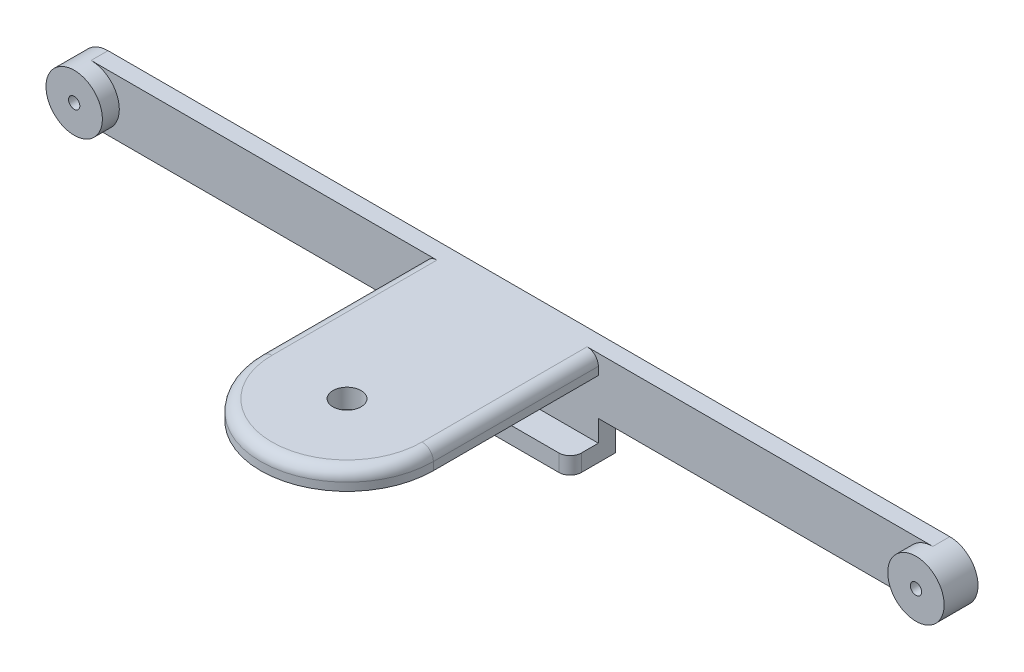
ISO-10303-21;
HEADER;
FILE_DESCRIPTION(('STEP AP214'),'2;1');
FILE_NAME('part.step','',(''),(''),'','','');
FILE_SCHEMA(('AUTOMOTIVE_DESIGN { 1 0 10303 214 1 1 1 1 }'));
ENDSEC;
DATA;
#1=APPLICATION_CONTEXT('core data for automotive mechanical design processes');
#2=APPLICATION_PROTOCOL_DEFINITION('international standard','automotive_design',2000,#1);
#3=PRODUCT_CONTEXT('',#1,'mechanical');
#4=PRODUCT('Part','Part','',(#3));
#5=PRODUCT_RELATED_PRODUCT_CATEGORY('part','',(#4));
#6=PRODUCT_DEFINITION_FORMATION('','',#4);
#7=PRODUCT_DEFINITION_CONTEXT('part definition',#1,'design');
#8=PRODUCT_DEFINITION('design','',#6,#7);
#9=PRODUCT_DEFINITION_SHAPE('','',#8);
#10=(LENGTH_UNIT() NAMED_UNIT(*) SI_UNIT(.MILLI.,.METRE.));
#11=(NAMED_UNIT(*) PLANE_ANGLE_UNIT() SI_UNIT($,.RADIAN.));
#12=(NAMED_UNIT(*) SI_UNIT($,.STERADIAN.) SOLID_ANGLE_UNIT());
#13=UNCERTAINTY_MEASURE_WITH_UNIT(LENGTH_MEASURE(1.E-05),#10,'distance_accuracy_value','');
#14=(GEOMETRIC_REPRESENTATION_CONTEXT(3) GLOBAL_UNCERTAINTY_ASSIGNED_CONTEXT((#13)) GLOBAL_UNIT_ASSIGNED_CONTEXT((#10,
#11,#12)) REPRESENTATION_CONTEXT('',''));
#15=CARTESIAN_POINT('',(0.,0.,0.));
#16=DIRECTION('',(0.,0.,1.));
#17=DIRECTION('',(1.,0.,0.));
#18=AXIS2_PLACEMENT_3D('',#15,#16,#17);
#19=CARTESIAN_POINT('',(-64.2061625282167,-0.784988713318295,3.));
#20=DIRECTION('',(0.,1.,0.));
#21=DIRECTION('',(0.,0.,1.));
#22=AXIS2_PLACEMENT_3D('',#19,#20,#21);
#23=PLANE('',#22);
#24=DIRECTION('',(0.,0.,1.));
#25=VECTOR('',#24,1.);
#26=CARTESIAN_POINT('',(25.7188374717833,-0.784988713318295,0.));
#27=LINE('',#26,#25);
#28=CARTESIAN_POINT('',(25.7188374717833,-0.784988713318295,0.));
#29=VERTEX_POINT('',#28);
#30=CARTESIAN_POINT('',(25.7188374717833,-0.784988713318295,3.));
#31=VERTEX_POINT('',#30);
#32=EDGE_CURVE('E207',#29,#31,#27,.T.);
#33=ORIENTED_EDGE('',*,*,#32,.F.);
#34=DIRECTION('',(1.,0.,0.));
#35=VECTOR('',#34,1.);
#36=CARTESIAN_POINT('',(-64.2061625282167,-0.784988713318295,0.));
#37=LINE('',#36,#35);
#38=CARTESIAN_POINT('',(85.0238374717833,-0.784988713318295,0.));
#39=VERTEX_POINT('',#38);
#40=EDGE_CURVE('E319',#29,#39,#37,.T.);
#41=ORIENTED_EDGE('',*,*,#40,.T.);
#42=DIRECTION('',(0.,0.,-1.));
#43=VECTOR('',#42,1.);
#44=CARTESIAN_POINT('',(85.0238374717833,-0.784988713318295,3.));
#45=LINE('',#44,#43);
#46=CARTESIAN_POINT('',(85.0238374717833,-0.784988713318295,3.));
#47=VERTEX_POINT('',#46);
#48=EDGE_CURVE('E336',#47,#39,#45,.T.);
#49=ORIENTED_EDGE('',*,*,#48,.F.);
#50=DIRECTION('',(1.,0.,0.));
#51=VECTOR('',#50,1.);
#52=CARTESIAN_POINT('',(-64.2061625282167,-0.784988713318295,3.));
#53=LINE('',#52,#51);
#54=EDGE_CURVE('E311',#31,#47,#53,.T.);
#55=ORIENTED_EDGE('',*,*,#54,.F.);
#56=EDGE_LOOP('',(#33,#41,#49,#55));
#57=FACE_BOUND('',#56,.T.);
#58=ADVANCED_FACE('F39',(#57),#23,.F.);
#59=DIRECTION('',(0.,0.,-1.));
#60=VECTOR('',#59,1.);
#61=CARTESIAN_POINT('',(-4.90116252821673,-0.784988713318295,0.));
#62=LINE('',#61,#60);
#63=CARTESIAN_POINT('',(-4.90116252821673,-0.784988713318295,3.));
#64=VERTEX_POINT('',#63);
#65=CARTESIAN_POINT('',(-4.90116252821673,-0.784988713318295,0.));
#66=VERTEX_POINT('',#65);
#67=EDGE_CURVE('E189',#64,#66,#62,.T.);
#68=ORIENTED_EDGE('',*,*,#67,.F.);
#69=CARTESIAN_POINT('',(-64.2061625282167,-0.784988713318295,3.));
#70=VERTEX_POINT('',#69);
#71=EDGE_CURVE('E306',#70,#64,#53,.T.);
#72=ORIENTED_EDGE('',*,*,#71,.F.);
#73=DIRECTION('',(0.,0.,-1.));
#74=VECTOR('',#73,1.);
#75=CARTESIAN_POINT('',(-64.2061625282167,-0.784988713318295,3.));
#76=LINE('',#75,#74);
#77=CARTESIAN_POINT('',(-64.2061625282167,-0.784988713318295,0.));
#78=VERTEX_POINT('',#77);
#79=EDGE_CURVE('E305',#70,#78,#76,.T.);
#80=ORIENTED_EDGE('',*,*,#79,.T.);
#81=EDGE_CURVE('E320',#78,#66,#37,.T.);
#82=ORIENTED_EDGE('',*,*,#81,.T.);
#83=EDGE_LOOP('',(#68,#72,#80,#82));
#84=FACE_BOUND('',#83,.T.);
#85=ADVANCED_FACE('F429',(#84),#23,.F.);
#86=CARTESIAN_POINT('',(-64.2061625282167,4.2150112866817,3.));
#87=DIRECTION('',(0.,0.,-1.));
#88=DIRECTION('',(-1.,0.,0.));
#89=AXIS2_PLACEMENT_3D('',#86,#87,#88);
#90=CYLINDRICAL_SURFACE('',#89,5.);
#91=CARTESIAN_POINT('',(-64.2061625282167,4.2150112866817,0.));
#92=DIRECTION('',(0.,0.,1.));
#93=DIRECTION('',(1.,0.,0.));
#94=AXIS2_PLACEMENT_3D('',#91,#92,#93);
#95=CIRCLE('',#94,5.);
#96=CARTESIAN_POINT('',(-64.2061625282167,9.2150112866817,0.));
#97=VERTEX_POINT('',#96);
#98=EDGE_CURVE('E299',#97,#78,#95,.T.);
#99=ORIENTED_EDGE('',*,*,#98,.T.);
#100=ORIENTED_EDGE('',*,*,#79,.F.);
#101=CARTESIAN_POINT('',(-64.2061625282167,4.2150112866817,3.));
#102=DIRECTION('',(0.,0.,1.));
#103=DIRECTION('',(1.,0.,0.));
#104=AXIS2_PLACEMENT_3D('',#101,#102,#103);
#105=CIRCLE('',#104,5.);
#106=CARTESIAN_POINT('',(-64.2061625282167,9.2150112866817,3.));
#107=VERTEX_POINT('',#106);
#108=EDGE_CURVE('E300',#70,#107,#105,.T.);
#109=ORIENTED_EDGE('',*,*,#108,.T.);
#110=DIRECTION('',(0.,0.,-1.));
#111=VECTOR('',#110,1.);
#112=CARTESIAN_POINT('',(-64.2061625282167,9.2150112866817,3.));
#113=LINE('',#112,#111);
#114=EDGE_CURVE('E315',#107,#97,#113,.T.);
#115=ORIENTED_EDGE('',*,*,#114,.T.);
#116=EDGE_LOOP('',(#99,#100,#109,#115));
#117=FACE_BOUND('',#116,.T.);
#118=CARTESIAN_POINT('',(-64.2061625282167,4.2150112866817,6.));
#119=DIRECTION('',(0.,0.,1.));
#120=DIRECTION('',(1.,0.,0.));
#121=AXIS2_PLACEMENT_3D('',#118,#119,#120);
#122=CIRCLE('',#121,5.);
#123=CARTESIAN_POINT('',(-59.2061625282167,4.2150112866817,6.));
#124=VERTEX_POINT('',#123);
#125=EDGE_CURVE('E295',#124,#124,#122,.T.);
#126=ORIENTED_EDGE('',*,*,#125,.F.);
#127=EDGE_LOOP('',(#126));
#128=FACE_BOUND('',#127,.T.);
#129=ADVANCED_FACE('F435',(#117,#128),#90,.T.);
#130=CARTESIAN_POINT('',(85.0238374717833,4.2150112866817,3.));
#131=DIRECTION('',(0.,0.,-1.));
#132=DIRECTION('',(-1.,0.,0.));
#133=AXIS2_PLACEMENT_3D('',#130,#131,#132);
#134=CYLINDRICAL_SURFACE('',#133,5.);
#135=CARTESIAN_POINT('',(85.0238374717833,4.2150112866817,0.));
#136=DIRECTION('',(0.,0.,1.));
#137=DIRECTION('',(1.,0.,0.));
#138=AXIS2_PLACEMENT_3D('',#135,#136,#137);
#139=CIRCLE('',#138,5.);
#140=CARTESIAN_POINT('',(85.0238374717833,9.2150112866817,0.));
#141=VERTEX_POINT('',#140);
#142=EDGE_CURVE('E323',#39,#141,#139,.T.);
#143=ORIENTED_EDGE('',*,*,#142,.T.);
#144=DIRECTION('',(0.,0.,-1.));
#145=VECTOR('',#144,1.);
#146=CARTESIAN_POINT('',(85.0238374717833,9.2150112866817,3.));
#147=LINE('',#146,#145);
#148=CARTESIAN_POINT('',(85.0238374717833,9.21501128668171,3.));
#149=VERTEX_POINT('',#148);
#150=EDGE_CURVE('E332',#149,#141,#147,.T.);
#151=ORIENTED_EDGE('',*,*,#150,.F.);
#152=CARTESIAN_POINT('',(85.0238374717833,4.2150112866817,3.));
#153=DIRECTION('',(0.,0.,1.));
#154=DIRECTION('',(1.,0.,0.));
#155=AXIS2_PLACEMENT_3D('',#152,#153,#154);
#156=CIRCLE('',#155,5.);
#157=EDGE_CURVE('E283',#149,#47,#156,.T.);
#158=ORIENTED_EDGE('',*,*,#157,.T.);
#159=ORIENTED_EDGE('',*,*,#48,.T.);
#160=EDGE_LOOP('',(#143,#151,#158,#159));
#161=FACE_BOUND('',#160,.T.);
#162=CARTESIAN_POINT('',(85.0238374717833,4.2150112866817,6.));
#163=DIRECTION('',(0.,0.,1.));
#164=DIRECTION('',(1.,0.,0.));
#165=AXIS2_PLACEMENT_3D('',#162,#163,#164);
#166=CIRCLE('',#165,5.);
#167=CARTESIAN_POINT('',(90.0238374717833,4.2150112866817,6.));
#168=VERTEX_POINT('',#167);
#169=EDGE_CURVE('E284',#168,#168,#166,.T.);
#170=ORIENTED_EDGE('',*,*,#169,.F.);
#171=EDGE_LOOP('',(#170));
#172=FACE_BOUND('',#171,.T.);
#173=ADVANCED_FACE('F440',(#161,#172),#134,.T.);
#174=CARTESIAN_POINT('',(-64.2061625282167,9.2150112866817,3.));
#175=DIRECTION('',(0.,-1.,0.));
#176=DIRECTION('',(0.,0.,-1.));
#177=AXIS2_PLACEMENT_3D('',#174,#175,#176);
#178=PLANE('',#177);
#179=DIRECTION('',(0.,0.,-1.));
#180=VECTOR('',#179,1.);
#181=CARTESIAN_POINT('',(23.7188374717833,9.2150112866817,3.));
#182=LINE('',#181,#180);
#183=CARTESIAN_POINT('',(23.7188374717833,9.2150112866817,32.25));
#184=VERTEX_POINT('',#183);
#185=CARTESIAN_POINT('',(23.7188374717833,9.2150112866817,3.));
#186=VERTEX_POINT('',#185);
#187=EDGE_CURVE('E348',#184,#186,#182,.T.);
#188=ORIENTED_EDGE('',*,*,#187,.T.);
#189=DIRECTION('',(-1.,0.,0.));
#190=VECTOR('',#189,1.);
#191=CARTESIAN_POINT('',(-64.2061625282167,9.2150112866817,3.));
#192=LINE('',#191,#190);
#193=EDGE_CURVE('E312',#149,#186,#192,.T.);
#194=ORIENTED_EDGE('',*,*,#193,.F.);
#195=ORIENTED_EDGE('',*,*,#150,.T.);
#196=DIRECTION('',(-1.,0.,0.));
#197=VECTOR('',#196,1.);
#198=CARTESIAN_POINT('',(-64.2061625282167,9.2150112866817,0.));
#199=LINE('',#198,#197);
#200=EDGE_CURVE('E326',#141,#97,#199,.T.);
#201=ORIENTED_EDGE('',*,*,#200,.T.);
#202=ORIENTED_EDGE('',*,*,#114,.F.);
#203=CARTESIAN_POINT('',(-2.90116252821673,9.2150112866817,3.));
#204=VERTEX_POINT('',#203);
#205=EDGE_CURVE('E310',#204,#107,#192,.T.);
#206=ORIENTED_EDGE('',*,*,#205,.F.);
#207=DIRECTION('',(0.,0.,1.));
#208=VECTOR('',#207,1.);
#209=CARTESIAN_POINT('',(-2.90116252821672,9.2150112866817,32.25));
#210=LINE('',#209,#208);
#211=CARTESIAN_POINT('',(-2.90116252821672,9.2150112866817,32.25));
#212=VERTEX_POINT('',#211);
#213=EDGE_CURVE('E304',#204,#212,#210,.T.);
#214=ORIENTED_EDGE('',*,*,#213,.T.);
#215=CARTESIAN_POINT('',(10.4088374717833,9.2150112866817,32.25));
#216=DIRECTION('',(0.,-1.,0.));
#217=DIRECTION('',(0.,0.,-1.));
#218=AXIS2_PLACEMENT_3D('',#215,#216,#217);
#219=CIRCLE('',#218,13.31);
#220=EDGE_CURVE('E345',#212,#184,#219,.F.);
#221=ORIENTED_EDGE('',*,*,#220,.T.);
#222=EDGE_LOOP('',(#188,#194,#195,#201,#202,#206,#214,#221));
#223=FACE_BOUND('',#222,.T.);
#224=CARTESIAN_POINT('',(10.4088374717833,9.2150112866817,32.25));
#225=DIRECTION('',(0.,1.,0.));
#226=DIRECTION('',(0.,0.,1.));
#227=AXIS2_PLACEMENT_3D('',#224,#225,#226);
#228=CIRCLE('',#227,2.5);
#229=CARTESIAN_POINT('',(10.4088374717833,9.2150112866817,34.75));
#230=VERTEX_POINT('',#229);
#231=EDGE_CURVE('E233',#230,#230,#228,.T.);
#232=ORIENTED_EDGE('',*,*,#231,.F.);
#233=EDGE_LOOP('',(#232));
#234=FACE_BOUND('',#233,.T.);
#235=ADVANCED_FACE('F474',(#223,#234),#178,.F.);
#236=CARTESIAN_POINT('',(-64.2061625282167,4.2150112866817,3.));
#237=DIRECTION('',(0.,0.,1.));
#238=DIRECTION('',(1.,0.,0.));
#239=AXIS2_PLACEMENT_3D('',#236,#237,#238);
#240=PLANE('',#239);
#241=DIRECTION('',(0.,1.,0.));
#242=VECTOR('',#241,1.);
#243=CARTESIAN_POINT('',(25.7188374717833,5.8050112866817,3.));
#244=LINE('',#243,#242);
#245=CARTESIAN_POINT('',(25.7188374717833,5.8050112866817,3.));
#246=VERTEX_POINT('',#245);
#247=CARTESIAN_POINT('',(25.7188374717833,7.2150112866817,3.));
#248=VERTEX_POINT('',#247);
#249=EDGE_CURVE('E255',#246,#248,#244,.T.);
#250=ORIENTED_EDGE('',*,*,#249,.F.);
#251=DIRECTION('',(-1.,0.,0.));
#252=VECTOR('',#251,1.);
#253=CARTESIAN_POINT('',(-4.90116252821673,5.8050112866817,2.99999999999999));
#254=LINE('',#253,#252);
#255=CARTESIAN_POINT('',(-4.90116252821673,5.8050112866817,3.));
#256=VERTEX_POINT('',#255);
#257=EDGE_CURVE('E245',#246,#256,#254,.T.);
#258=ORIENTED_EDGE('',*,*,#257,.T.);
#259=DIRECTION('',(0.,1.,0.));
#260=VECTOR('',#259,1.);
#261=CARTESIAN_POINT('',(-4.90116252821673,5.8050112866817,2.99999999999999));
#262=LINE('',#261,#260);
#263=CARTESIAN_POINT('',(-4.90116252821673,7.2150112866817,2.99999999999999));
#264=VERTEX_POINT('',#263);
#265=EDGE_CURVE('E265',#256,#264,#262,.T.);
#266=ORIENTED_EDGE('',*,*,#265,.T.);
#267=CARTESIAN_POINT('',(-2.90116252821673,7.2150112866817,3.));
#268=DIRECTION('',(0.,0.,1.));
#269=DIRECTION('',(1.,0.,0.));
#270=AXIS2_PLACEMENT_3D('',#267,#268,#269);
#271=CIRCLE('',#270,2.);
#272=EDGE_CURVE('E11',#264,#204,#271,.F.);
#273=ORIENTED_EDGE('',*,*,#272,.T.);
#274=ORIENTED_EDGE('',*,*,#205,.T.);
#275=ORIENTED_EDGE('',*,*,#108,.F.);
#276=ORIENTED_EDGE('',*,*,#71,.T.);
#277=DIRECTION('',(0.,1.,0.));
#278=VECTOR('',#277,1.);
#279=CARTESIAN_POINT('',(-4.90116252821673,-4.5849887133183,3.));
#280=LINE('',#279,#278);
#281=CARTESIAN_POINT('',(-4.90116252821673,-4.5849887133183,3.));
#282=VERTEX_POINT('',#281);
#283=EDGE_CURVE('E192',#282,#64,#280,.T.);
#284=ORIENTED_EDGE('',*,*,#283,.F.);
#285=DIRECTION('',(-1.,0.,0.));
#286=VECTOR('',#285,1.);
#287=CARTESIAN_POINT('',(-4.90116252821673,-4.5849887133183,3.));
#288=LINE('',#287,#286);
#289=CARTESIAN_POINT('',(25.7188374717833,-4.5849887133183,3.));
#290=VERTEX_POINT('',#289);
#291=EDGE_CURVE('E216',#290,#282,#288,.T.);
#292=ORIENTED_EDGE('',*,*,#291,.F.);
#293=DIRECTION('',(0.,1.,0.));
#294=VECTOR('',#293,1.);
#295=CARTESIAN_POINT('',(25.7188374717833,-4.5849887133183,3.));
#296=LINE('',#295,#294);
#297=EDGE_CURVE('E229',#290,#31,#296,.T.);
#298=ORIENTED_EDGE('',*,*,#297,.T.);
#299=ORIENTED_EDGE('',*,*,#54,.T.);
#300=ORIENTED_EDGE('',*,*,#157,.F.);
#301=ORIENTED_EDGE('',*,*,#193,.T.);
#302=CARTESIAN_POINT('',(23.7188374717833,7.2150112866817,3.));
#303=DIRECTION('',(0.,0.,1.));
#304=DIRECTION('',(1.,0.,0.));
#305=AXIS2_PLACEMENT_3D('',#302,#303,#304);
#306=CIRCLE('',#305,2.);
#307=EDGE_CURVE('E49',#186,#248,#306,.F.);
#308=ORIENTED_EDGE('',*,*,#307,.T.);
#309=EDGE_LOOP('',(#250,#258,#266,#273,#274,#275,#276,#284,#292,#298,#299,#300,#301,#308));
#310=FACE_BOUND('',#309,.T.);
#311=ADVANCED_FACE('F409',(#310),#240,.T.);
#312=CARTESIAN_POINT('',(-64.2061625282167,4.2150112866817,0.));
#313=DIRECTION('',(0.,0.,1.));
#314=DIRECTION('',(1.,0.,0.));
#315=AXIS2_PLACEMENT_3D('',#312,#313,#314);
#316=PLANE('',#315);
#317=CARTESIAN_POINT('',(85.0238374717833,4.2150112866817,0.));
#318=DIRECTION('',(0.,0.,1.));
#319=DIRECTION('',(1.,0.,0.));
#320=AXIS2_PLACEMENT_3D('',#317,#318,#319);
#321=CIRCLE('',#320,0.999999999999998);
#322=CARTESIAN_POINT('',(86.0238374717833,4.2150112866817,0.));
#323=VERTEX_POINT('',#322);
#324=EDGE_CURVE('E260',#323,#323,#321,.T.);
#325=ORIENTED_EDGE('',*,*,#324,.T.);
#326=EDGE_LOOP('',(#325));
#327=FACE_BOUND('',#326,.T.);
#328=CARTESIAN_POINT('',(-64.2061625282167,4.2150112866817,0.));
#329=DIRECTION('',(0.,0.,1.));
#330=DIRECTION('',(1.,0.,0.));
#331=AXIS2_PLACEMENT_3D('',#328,#329,#330);
#332=CIRCLE('',#331,0.999999999999998);
#333=CARTESIAN_POINT('',(-63.2061625282167,4.2150112866817,0.));
#334=VERTEX_POINT('',#333);
#335=EDGE_CURVE('E275',#334,#334,#332,.T.);
#336=ORIENTED_EDGE('',*,*,#335,.T.);
#337=EDGE_LOOP('',(#336));
#338=FACE_BOUND('',#337,.T.);
#339=ORIENTED_EDGE('',*,*,#98,.F.);
#340=ORIENTED_EDGE('',*,*,#200,.F.);
#341=ORIENTED_EDGE('',*,*,#142,.F.);
#342=ORIENTED_EDGE('',*,*,#40,.F.);
#343=DIRECTION('',(0.,1.,0.));
#344=VECTOR('',#343,1.);
#345=CARTESIAN_POINT('',(25.7188374717833,-4.5849887133183,0.));
#346=LINE('',#345,#344);
#347=CARTESIAN_POINT('',(25.7188374717833,-7.5849887133183,0.));
#348=VERTEX_POINT('',#347);
#349=EDGE_CURVE('E193',#348,#29,#346,.T.);
#350=ORIENTED_EDGE('',*,*,#349,.F.);
#351=DIRECTION('',(1.,0.,0.));
#352=VECTOR('',#351,1.);
#353=CARTESIAN_POINT('',(-4.90116252821673,-7.5849887133183,0.));
#354=LINE('',#353,#352);
#355=CARTESIAN_POINT('',(-4.90116252821673,-7.5849887133183,0.));
#356=VERTEX_POINT('',#355);
#357=EDGE_CURVE('E175',#356,#348,#354,.T.);
#358=ORIENTED_EDGE('',*,*,#357,.F.);
#359=DIRECTION('',(0.,1.,0.));
#360=VECTOR('',#359,1.);
#361=CARTESIAN_POINT('',(-4.90116252821673,-4.5849887133183,0.));
#362=LINE('',#361,#360);
#363=EDGE_CURVE('E186',#356,#66,#362,.T.);
#364=ORIENTED_EDGE('',*,*,#363,.T.);
#365=ORIENTED_EDGE('',*,*,#81,.F.);
#366=EDGE_LOOP('',(#339,#340,#341,#342,#350,#358,#364,#365));
#367=FACE_BOUND('',#366,.T.);
#368=ADVANCED_FACE('F196',(#327,#338,#367),#316,.F.);
#369=CARTESIAN_POINT('',(-64.2061625282167,4.2150112866817,6.));
#370=DIRECTION('',(0.,0.,1.));
#371=DIRECTION('',(1.,0.,0.));
#372=AXIS2_PLACEMENT_3D('',#369,#370,#371);
#373=PLANE('',#372);
#374=ORIENTED_EDGE('',*,*,#125,.T.);
#375=EDGE_LOOP('',(#374));
#376=FACE_BOUND('',#375,.T.);
#377=CARTESIAN_POINT('',(-64.2061625282167,4.2150112866817,6.));
#378=DIRECTION('',(0.,0.,1.));
#379=DIRECTION('',(1.,0.,0.));
#380=AXIS2_PLACEMENT_3D('',#377,#378,#379);
#381=CIRCLE('',#380,0.999999999999998);
#382=CARTESIAN_POINT('',(-63.2061625282167,4.2150112866817,6.));
#383=VERTEX_POINT('',#382);
#384=EDGE_CURVE('E288',#383,#383,#381,.T.);
#385=ORIENTED_EDGE('',*,*,#384,.F.);
#386=EDGE_LOOP('',(#385));
#387=FACE_BOUND('',#386,.T.);
#388=ADVANCED_FACE('F501',(#376,#387),#373,.T.);
#389=CARTESIAN_POINT('',(-64.2061625282167,4.2150112866817,6.));
#390=DIRECTION('',(0.,0.,-1.));
#391=DIRECTION('',(-1.,0.,0.));
#392=AXIS2_PLACEMENT_3D('',#389,#390,#391);
#393=CYLINDRICAL_SURFACE('',#392,0.999999999999998);
#394=ORIENTED_EDGE('',*,*,#384,.T.);
#395=EDGE_LOOP('',(#394));
#396=FACE_BOUND('',#395,.T.);
#397=ORIENTED_EDGE('',*,*,#335,.F.);
#398=EDGE_LOOP('',(#397));
#399=FACE_BOUND('',#398,.T.);
#400=ADVANCED_FACE('F490',(#396,#399),#393,.F.);
#401=CARTESIAN_POINT('',(85.0238374717833,4.2150112866817,6.));
#402=DIRECTION('',(0.,0.,1.));
#403=DIRECTION('',(1.,0.,0.));
#404=AXIS2_PLACEMENT_3D('',#401,#402,#403);
#405=PLANE('',#404);
#406=ORIENTED_EDGE('',*,*,#169,.T.);
#407=EDGE_LOOP('',(#406));
#408=FACE_BOUND('',#407,.T.);
#409=CARTESIAN_POINT('',(85.0238374717833,4.2150112866817,6.));
#410=DIRECTION('',(0.,0.,1.));
#411=DIRECTION('',(1.,0.,0.));
#412=AXIS2_PLACEMENT_3D('',#409,#410,#411);
#413=CIRCLE('',#412,0.999999999999998);
#414=CARTESIAN_POINT('',(86.0238374717833,4.2150112866817,6.));
#415=VERTEX_POINT('',#414);
#416=EDGE_CURVE('E279',#415,#415,#413,.T.);
#417=ORIENTED_EDGE('',*,*,#416,.F.);
#418=EDGE_LOOP('',(#417));
#419=FACE_BOUND('',#418,.T.);
#420=ADVANCED_FACE('F487',(#408,#419),#405,.T.);
#421=CARTESIAN_POINT('',(85.0238374717833,4.2150112866817,6.));
#422=DIRECTION('',(0.,0.,-1.));
#423=DIRECTION('',(-1.,0.,0.));
#424=AXIS2_PLACEMENT_3D('',#421,#422,#423);
#425=CYLINDRICAL_SURFACE('',#424,0.999999999999998);
#426=ORIENTED_EDGE('',*,*,#416,.T.);
#427=EDGE_LOOP('',(#426));
#428=FACE_BOUND('',#427,.T.);
#429=ORIENTED_EDGE('',*,*,#324,.F.);
#430=EDGE_LOOP('',(#429));
#431=FACE_BOUND('',#430,.T.);
#432=ADVANCED_FACE('F426',(#428,#431),#425,.F.);
#433=CARTESIAN_POINT('',(25.7188374717833,5.8050112866817,16.94));
#434=DIRECTION('',(1.,0.,0.));
#435=DIRECTION('',(0.,0.,-1.));
#436=AXIS2_PLACEMENT_3D('',#433,#434,#435);
#437=PLANE('',#436);
#438=ORIENTED_EDGE('',*,*,#249,.T.);
#439=DIRECTION('',(0.,0.,-1.));
#440=VECTOR('',#439,1.);
#441=CARTESIAN_POINT('',(25.7188374717833,7.2150112866817,32.25));
#442=LINE('',#441,#440);
#443=CARTESIAN_POINT('',(25.7188374717833,7.2150112866817,32.25));
#444=VERTEX_POINT('',#443);
#445=EDGE_CURVE('E352',#248,#444,#442,.F.);
#446=ORIENTED_EDGE('',*,*,#445,.T.);
#447=DIRECTION('',(0.,1.,0.));
#448=VECTOR('',#447,1.);
#449=CARTESIAN_POINT('',(25.7188374717833,5.8050112866817,32.25));
#450=LINE('',#449,#448);
#451=CARTESIAN_POINT('',(25.7188374717833,5.8050112866817,32.25));
#452=VERTEX_POINT('',#451);
#453=EDGE_CURVE('E256',#452,#444,#450,.T.);
#454=ORIENTED_EDGE('',*,*,#453,.F.);
#455=DIRECTION('',(0.,0.,-1.));
#456=VECTOR('',#455,1.);
#457=CARTESIAN_POINT('',(25.7188374717833,5.8050112866817,3.));
#458=LINE('',#457,#456);
#459=EDGE_CURVE('E238',#452,#246,#458,.T.);
#460=ORIENTED_EDGE('',*,*,#459,.T.);
#461=EDGE_LOOP('',(#438,#446,#454,#460));
#462=FACE_BOUND('',#461,.T.);
#463=ADVANCED_FACE('F416',(#462),#437,.T.);
#464=CARTESIAN_POINT('',(10.4088374717833,5.8050112866817,32.25));
#465=DIRECTION('',(0.,1.,0.));
#466=DIRECTION('',(0.,0.,1.));
#467=AXIS2_PLACEMENT_3D('',#464,#465,#466);
#468=CYLINDRICAL_SURFACE('',#467,15.31);
#469=ORIENTED_EDGE('',*,*,#453,.T.);
#470=CARTESIAN_POINT('',(10.4088374717833,7.2150112866817,32.25));
#471=DIRECTION('',(0.,-1.,0.));
#472=DIRECTION('',(0.,0.,-1.));
#473=AXIS2_PLACEMENT_3D('',#470,#471,#472);
#474=CIRCLE('',#473,15.31);
#475=CARTESIAN_POINT('',(-4.90116252821673,7.2150112866817,32.25));
#476=VERTEX_POINT('',#475);
#477=EDGE_CURVE('E355',#444,#476,#474,.T.);
#478=ORIENTED_EDGE('',*,*,#477,.T.);
#479=DIRECTION('',(0.,1.,0.));
#480=VECTOR('',#479,1.);
#481=CARTESIAN_POINT('',(-4.90116252821673,5.8050112866817,32.25));
#482=LINE('',#481,#480);
#483=CARTESIAN_POINT('',(-4.90116252821673,5.8050112866817,32.25));
#484=VERTEX_POINT('',#483);
#485=EDGE_CURVE('E261',#484,#476,#482,.T.);
#486=ORIENTED_EDGE('',*,*,#485,.F.);
#487=CARTESIAN_POINT('',(10.4088374717833,5.8050112866817,32.25));
#488=DIRECTION('',(0.,1.,0.));
#489=DIRECTION('',(0.,0.,1.));
#490=AXIS2_PLACEMENT_3D('',#487,#488,#489);
#491=CIRCLE('',#490,15.31);
#492=EDGE_CURVE('E251',#484,#452,#491,.T.);
#493=ORIENTED_EDGE('',*,*,#492,.T.);
#494=EDGE_LOOP('',(#469,#478,#486,#493));
#495=FACE_BOUND('',#494,.T.);
#496=ADVANCED_FACE('F418',(#495),#468,.T.);
#497=CARTESIAN_POINT('',(-4.90116252821673,5.8050112866817,16.94));
#498=DIRECTION('',(-1.,0.,0.));
#499=DIRECTION('',(0.,0.,1.));
#500=AXIS2_PLACEMENT_3D('',#497,#498,#499);
#501=PLANE('',#500);
#502=ORIENTED_EDGE('',*,*,#485,.T.);
#503=DIRECTION('',(0.,0.,1.));
#504=VECTOR('',#503,1.);
#505=CARTESIAN_POINT('',(-4.90116252821673,7.2150112866817,2.99999999999999));
#506=LINE('',#505,#504);
#507=EDGE_CURVE('E358',#476,#264,#506,.F.);
#508=ORIENTED_EDGE('',*,*,#507,.T.);
#509=ORIENTED_EDGE('',*,*,#265,.F.);
#510=DIRECTION('',(0.,0.,1.));
#511=VECTOR('',#510,1.);
#512=CARTESIAN_POINT('',(-4.90116252821673,5.8050112866817,2.99999999999999));
#513=LINE('',#512,#511);
#514=EDGE_CURVE('E248',#256,#484,#513,.T.);
#515=ORIENTED_EDGE('',*,*,#514,.T.);
#516=EDGE_LOOP('',(#502,#508,#509,#515));
#517=FACE_BOUND('',#516,.T.);
#518=ADVANCED_FACE('F405',(#517),#501,.T.);
#519=CARTESIAN_POINT('',(10.4088374717833,5.8050112866817,32.25));
#520=DIRECTION('',(0.,1.,0.));
#521=DIRECTION('',(0.,0.,1.));
#522=AXIS2_PLACEMENT_3D('',#519,#520,#521);
#523=PLANE('',#522);
#524=CARTESIAN_POINT('',(10.4088374717833,5.8050112866817,32.25));
#525=DIRECTION('',(0.,1.,0.));
#526=DIRECTION('',(0.,0.,1.));
#527=AXIS2_PLACEMENT_3D('',#524,#525,#526);
#528=CIRCLE('',#527,2.5);
#529=CARTESIAN_POINT('',(10.4088374717833,5.8050112866817,34.75));
#530=VERTEX_POINT('',#529);
#531=EDGE_CURVE('E234',#530,#530,#528,.T.);
#532=ORIENTED_EDGE('',*,*,#531,.T.);
#533=EDGE_LOOP('',(#532));
#534=FACE_BOUND('',#533,.T.);
#535=ORIENTED_EDGE('',*,*,#459,.F.);
#536=ORIENTED_EDGE('',*,*,#492,.F.);
#537=ORIENTED_EDGE('',*,*,#514,.F.);
#538=ORIENTED_EDGE('',*,*,#257,.F.);
#539=EDGE_LOOP('',(#535,#536,#537,#538));
#540=FACE_BOUND('',#539,.T.);
#541=ADVANCED_FACE('F412',(#534,#540),#523,.F.);
#542=CARTESIAN_POINT('',(10.4088374717833,5.8050112866817,32.25));
#543=DIRECTION('',(0.,1.,0.));
#544=DIRECTION('',(0.,0.,1.));
#545=AXIS2_PLACEMENT_3D('',#542,#543,#544);
#546=CYLINDRICAL_SURFACE('',#545,2.5);
#547=ORIENTED_EDGE('',*,*,#531,.F.);
#548=EDGE_LOOP('',(#547));
#549=FACE_BOUND('',#548,.T.);
#550=ORIENTED_EDGE('',*,*,#231,.T.);
#551=EDGE_LOOP('',(#550));
#552=FACE_BOUND('',#551,.T.);
#553=ADVANCED_FACE('F564',(#549,#552),#546,.F.);
#554=CARTESIAN_POINT('',(25.7188374717833,-4.5849887133183,0.));
#555=DIRECTION('',(-1.,0.,0.));
#556=DIRECTION('',(0.,0.,1.));
#557=AXIS2_PLACEMENT_3D('',#554,#555,#556);
#558=PLANE('',#557);
#559=DIRECTION('',(0.,0.,1.));
#560=VECTOR('',#559,1.);
#561=CARTESIAN_POINT('',(25.7188374717833,-4.5849887133183,0.));
#562=LINE('',#561,#560);
#563=CARTESIAN_POINT('',(25.7188374717833,-4.5849887133183,6.));
#564=VERTEX_POINT('',#563);
#565=EDGE_CURVE('E211',#290,#564,#562,.T.);
#566=ORIENTED_EDGE('',*,*,#565,.T.);
#567=DIRECTION('',(0.,1.,0.));
#568=VECTOR('',#567,1.);
#569=CARTESIAN_POINT('',(25.7188374717833,-4.5849887133183,6.));
#570=LINE('',#569,#568);
#571=CARTESIAN_POINT('',(25.7188374717833,-7.5849887133183,6.));
#572=VERTEX_POINT('',#571);
#573=EDGE_CURVE('E57',#564,#572,#570,.F.);
#574=ORIENTED_EDGE('',*,*,#573,.T.);
#575=DIRECTION('',(0.,0.,1.));
#576=VECTOR('',#575,1.);
#577=CARTESIAN_POINT('',(25.7188374717833,-7.5849887133183,0.));
#578=LINE('',#577,#576);
#579=EDGE_CURVE('E199',#348,#572,#578,.T.);
#580=ORIENTED_EDGE('',*,*,#579,.F.);
#581=ORIENTED_EDGE('',*,*,#349,.T.);
#582=ORIENTED_EDGE('',*,*,#32,.T.);
#583=ORIENTED_EDGE('',*,*,#297,.F.);
#584=EDGE_LOOP('',(#566,#574,#580,#581,#582,#583));
#585=FACE_BOUND('',#584,.T.);
#586=ADVANCED_FACE('F465',(#585),#558,.F.);
#587=CARTESIAN_POINT('',(-4.90116252821673,-4.5849887133183,0.));
#588=DIRECTION('',(1.,0.,0.));
#589=DIRECTION('',(0.,0.,-1.));
#590=AXIS2_PLACEMENT_3D('',#587,#588,#589);
#591=PLANE('',#590);
#592=DIRECTION('',(0.,0.,-1.));
#593=VECTOR('',#592,1.);
#594=CARTESIAN_POINT('',(-4.90116252821673,-7.5849887133183,0.));
#595=LINE('',#594,#593);
#596=CARTESIAN_POINT('',(-4.90116252821673,-7.5849887133183,6.));
#597=VERTEX_POINT('',#596);
#598=EDGE_CURVE('E171',#597,#356,#595,.T.);
#599=ORIENTED_EDGE('',*,*,#598,.F.);
#600=DIRECTION('',(0.,1.,0.));
#601=VECTOR('',#600,1.);
#602=CARTESIAN_POINT('',(-4.90116252821673,-4.5849887133183,6.));
#603=LINE('',#602,#601);
#604=CARTESIAN_POINT('',(-4.90116252821673,-4.5849887133183,6.));
#605=VERTEX_POINT('',#604);
#606=EDGE_CURVE('E361',#597,#605,#603,.T.);
#607=ORIENTED_EDGE('',*,*,#606,.T.);
#608=DIRECTION('',(0.,0.,-1.));
#609=VECTOR('',#608,1.);
#610=CARTESIAN_POINT('',(-4.90116252821673,-4.5849887133183,0.));
#611=LINE('',#610,#609);
#612=EDGE_CURVE('E208',#605,#282,#611,.T.);
#613=ORIENTED_EDGE('',*,*,#612,.T.);
#614=ORIENTED_EDGE('',*,*,#283,.T.);
#615=ORIENTED_EDGE('',*,*,#67,.T.);
#616=ORIENTED_EDGE('',*,*,#363,.F.);
#617=EDGE_LOOP('',(#599,#607,#613,#614,#615,#616));
#618=FACE_BOUND('',#617,.T.);
#619=ADVANCED_FACE('F187',(#618),#591,.F.);
#620=CARTESIAN_POINT('',(-4.90116252821673,-7.5849887133183,8.));
#621=DIRECTION('',(0.,0.,-1.));
#622=DIRECTION('',(-1.,0.,0.));
#623=AXIS2_PLACEMENT_3D('',#620,#621,#622);
#624=PLANE('',#623);
#625=DIRECTION('',(-1.,0.,0.));
#626=VECTOR('',#625,1.);
#627=CARTESIAN_POINT('',(-4.90116252821673,-4.5849887133183,8.));
#628=LINE('',#627,#626);
#629=CARTESIAN_POINT('',(23.7188374717833,-4.5849887133183,8.));
#630=VERTEX_POINT('',#629);
#631=CARTESIAN_POINT('',(-2.90116252821673,-4.5849887133183,8.));
#632=VERTEX_POINT('',#631);
#633=EDGE_CURVE('E182',#630,#632,#628,.T.);
#634=ORIENTED_EDGE('',*,*,#633,.T.);
#635=DIRECTION('',(0.,1.,0.));
#636=VECTOR('',#635,1.);
#637=CARTESIAN_POINT('',(-2.90116252821673,-7.5849887133183,8.));
#638=LINE('',#637,#636);
#639=CARTESIAN_POINT('',(-2.90116252821673,-7.5849887133183,8.));
#640=VERTEX_POINT('',#639);
#641=EDGE_CURVE('E65',#632,#640,#638,.F.);
#642=ORIENTED_EDGE('',*,*,#641,.T.);
#643=DIRECTION('',(-1.,0.,0.));
#644=VECTOR('',#643,1.);
#645=CARTESIAN_POINT('',(-4.90116252821673,-7.5849887133183,8.));
#646=LINE('',#645,#644);
#647=CARTESIAN_POINT('',(23.7188374717833,-7.5849887133183,8.));
#648=VERTEX_POINT('',#647);
#649=EDGE_CURVE('E202',#648,#640,#646,.T.);
#650=ORIENTED_EDGE('',*,*,#649,.F.);
#651=DIRECTION('',(0.,1.,0.));
#652=VECTOR('',#651,1.);
#653=CARTESIAN_POINT('',(23.7188374717833,-7.5849887133183,8.));
#654=LINE('',#653,#652);
#655=EDGE_CURVE('E370',#648,#630,#654,.T.);
#656=ORIENTED_EDGE('',*,*,#655,.T.);
#657=EDGE_LOOP('',(#634,#642,#650,#656));
#658=FACE_BOUND('',#657,.T.);
#659=ADVANCED_FACE('F634',(#658),#624,.F.);
#660=CARTESIAN_POINT('',(0.,-7.5849887133183,0.));
#661=DIRECTION('',(0.,1.,0.));
#662=DIRECTION('',(0.,0.,1.));
#663=AXIS2_PLACEMENT_3D('',#660,#661,#662);
#664=PLANE('',#663);
#665=ORIENTED_EDGE('',*,*,#649,.T.);
#666=CARTESIAN_POINT('',(-2.90116252821673,-7.5849887133183,6.));
#667=DIRECTION('',(0.,1.,0.));
#668=DIRECTION('',(0.,0.,1.));
#669=AXIS2_PLACEMENT_3D('',#666,#667,#668);
#670=CIRCLE('',#669,2.);
#671=EDGE_CURVE('E177',#640,#597,#670,.F.);
#672=ORIENTED_EDGE('',*,*,#671,.T.);
#673=ORIENTED_EDGE('',*,*,#598,.T.);
#674=ORIENTED_EDGE('',*,*,#357,.T.);
#675=ORIENTED_EDGE('',*,*,#579,.T.);
#676=CARTESIAN_POINT('',(23.7188374717833,-7.5849887133183,6.));
#677=DIRECTION('',(0.,1.,0.));
#678=DIRECTION('',(0.,0.,1.));
#679=AXIS2_PLACEMENT_3D('',#676,#677,#678);
#680=CIRCLE('',#679,2.);
#681=EDGE_CURVE('E376',#572,#648,#680,.F.);
#682=ORIENTED_EDGE('',*,*,#681,.T.);
#683=EDGE_LOOP('',(#665,#672,#673,#674,#675,#682));
#684=FACE_BOUND('',#683,.T.);
#685=ADVANCED_FACE('F173',(#684),#664,.F.);
#686=CARTESIAN_POINT('',(0.,-4.5849887133183,0.));
#687=DIRECTION('',(0.,1.,0.));
#688=DIRECTION('',(0.,0.,1.));
#689=AXIS2_PLACEMENT_3D('',#686,#687,#688);
#690=PLANE('',#689);
#691=ORIENTED_EDGE('',*,*,#612,.F.);
#692=CARTESIAN_POINT('',(-2.90116252821673,-4.5849887133183,6.));
#693=DIRECTION('',(0.,1.,0.));
#694=DIRECTION('',(0.,0.,1.));
#695=AXIS2_PLACEMENT_3D('',#692,#693,#694);
#696=CIRCLE('',#695,2.);
#697=EDGE_CURVE('E367',#605,#632,#696,.T.);
#698=ORIENTED_EDGE('',*,*,#697,.T.);
#699=ORIENTED_EDGE('',*,*,#633,.F.);
#700=CARTESIAN_POINT('',(23.7188374717833,-4.5849887133183,6.));
#701=DIRECTION('',(0.,1.,0.));
#702=DIRECTION('',(0.,0.,1.));
#703=AXIS2_PLACEMENT_3D('',#700,#701,#702);
#704=CIRCLE('',#703,2.);
#705=EDGE_CURVE('E364',#630,#564,#704,.T.);
#706=ORIENTED_EDGE('',*,*,#705,.T.);
#707=ORIENTED_EDGE('',*,*,#565,.F.);
#708=ORIENTED_EDGE('',*,*,#291,.T.);
#709=EDGE_LOOP('',(#691,#698,#699,#706,#707,#708));
#710=FACE_BOUND('',#709,.T.);
#711=ADVANCED_FACE('F452',(#710),#690,.T.);
#712=CARTESIAN_POINT('',(-2.90116252821673,7.2150112866817,3.));
#713=DIRECTION('',(0.,0.,-1.));
#714=DIRECTION('',(-1.,0.,0.));
#715=AXIS2_PLACEMENT_3D('',#712,#713,#714);
#716=CYLINDRICAL_SURFACE('',#715,2.);
#717=ORIENTED_EDGE('',*,*,#272,.F.);
#718=ORIENTED_EDGE('',*,*,#507,.F.);
#719=CARTESIAN_POINT('',(-2.90116252821672,7.2150112866817,32.25));
#720=DIRECTION('',(0.,0.,1.));
#721=DIRECTION('',(1.,0.,0.));
#722=AXIS2_PLACEMENT_3D('',#719,#720,#721);
#723=CIRCLE('',#722,2.);
#724=EDGE_CURVE('E43',#212,#476,#723,.T.);
#725=ORIENTED_EDGE('',*,*,#724,.F.);
#726=ORIENTED_EDGE('',*,*,#213,.F.);
#727=EDGE_LOOP('',(#717,#718,#725,#726));
#728=FACE_BOUND('',#727,.T.);
#729=ADVANCED_FACE('F402',(#728),#716,.T.);
#730=CARTESIAN_POINT('',(10.4088374717833,7.2150112866817,32.25));
#731=DIRECTION('',(0.,-1.,0.));
#732=DIRECTION('',(0.,0.,-1.));
#733=AXIS2_PLACEMENT_3D('',#730,#731,#732);
#734=TOROIDAL_SURFACE('',#733,13.31,2.);
#735=ORIENTED_EDGE('',*,*,#724,.T.);
#736=ORIENTED_EDGE('',*,*,#477,.F.);
#737=CARTESIAN_POINT('',(23.7188374717833,7.2150112866817,32.25));
#738=DIRECTION('',(0.,0.,-1.));
#739=DIRECTION('',(-1.,0.,0.));
#740=AXIS2_PLACEMENT_3D('',#737,#738,#739);
#741=CIRCLE('',#740,2.);
#742=EDGE_CURVE('E384',#184,#444,#741,.T.);
#743=ORIENTED_EDGE('',*,*,#742,.F.);
#744=ORIENTED_EDGE('',*,*,#220,.F.);
#745=EDGE_LOOP('',(#735,#736,#743,#744));
#746=FACE_BOUND('',#745,.T.);
#747=ADVANCED_FACE('F397',(#746),#734,.T.);
#748=CARTESIAN_POINT('',(23.7188374717833,7.2150112866817,3.));
#749=DIRECTION('',(0.,0.,1.));
#750=DIRECTION('',(1.,0.,0.));
#751=AXIS2_PLACEMENT_3D('',#748,#749,#750);
#752=CYLINDRICAL_SURFACE('',#751,2.);
#753=ORIENTED_EDGE('',*,*,#742,.T.);
#754=ORIENTED_EDGE('',*,*,#445,.F.);
#755=ORIENTED_EDGE('',*,*,#307,.F.);
#756=ORIENTED_EDGE('',*,*,#187,.F.);
#757=EDGE_LOOP('',(#753,#754,#755,#756));
#758=FACE_BOUND('',#757,.T.);
#759=ADVANCED_FACE('F445',(#758),#752,.T.);
#760=CARTESIAN_POINT('',(-2.90116252821673,-4.5849887133183,6.));
#761=DIRECTION('',(0.,1.,0.));
#762=DIRECTION('',(0.,0.,1.));
#763=AXIS2_PLACEMENT_3D('',#760,#761,#762);
#764=CYLINDRICAL_SURFACE('',#763,2.);
#765=ORIENTED_EDGE('',*,*,#671,.F.);
#766=ORIENTED_EDGE('',*,*,#641,.F.);
#767=ORIENTED_EDGE('',*,*,#697,.F.);
#768=ORIENTED_EDGE('',*,*,#606,.F.);
#769=EDGE_LOOP('',(#765,#766,#767,#768));
#770=FACE_BOUND('',#769,.T.);
#771=ADVANCED_FACE('F448',(#770),#764,.T.);
#772=CARTESIAN_POINT('',(23.7188374717833,-7.5849887133183,6.));
#773=DIRECTION('',(0.,1.,0.));
#774=DIRECTION('',(0.,0.,1.));
#775=AXIS2_PLACEMENT_3D('',#772,#773,#774);
#776=CYLINDRICAL_SURFACE('',#775,2.);
#777=ORIENTED_EDGE('',*,*,#681,.F.);
#778=ORIENTED_EDGE('',*,*,#573,.F.);
#779=ORIENTED_EDGE('',*,*,#705,.F.);
#780=ORIENTED_EDGE('',*,*,#655,.F.);
#781=EDGE_LOOP('',(#777,#778,#779,#780));
#782=FACE_BOUND('',#781,.T.);
#783=ADVANCED_FACE('F41',(#782),#776,.T.);
#784=CLOSED_SHELL('',(#58,#85,#129,#173,#235,#311,#368,#388,#400,#420,#432,#463,#496,#518,#541,
#553,#586,#619,#659,#685,#711,#729,#747,#759,#771,#783));
#785=MANIFOLD_SOLID_BREP('B2',#784);
#786=ADVANCED_BREP_SHAPE_REPRESENTATION('',(#18,#785),#14);
#787=SHAPE_DEFINITION_REPRESENTATION(#9,#786);
ENDSEC;
END-ISO-10303-21;
